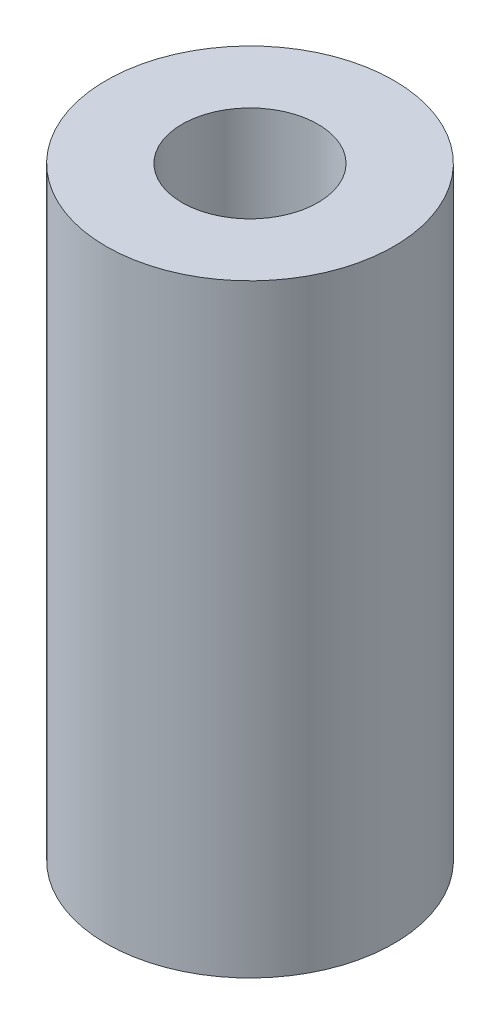
ISO-10303-21;
HEADER;
FILE_DESCRIPTION(('STEP AP214'),'2;1');
FILE_NAME('part.step','',(''),(''),'','','');
FILE_SCHEMA(('AUTOMOTIVE_DESIGN { 1 0 10303 214 1 1 1 1 }'));
ENDSEC;
DATA;
#1=APPLICATION_CONTEXT('core data for automotive mechanical design processes');
#2=APPLICATION_PROTOCOL_DEFINITION('international standard','automotive_design',2000,#1);
#3=PRODUCT_CONTEXT('',#1,'mechanical');
#4=PRODUCT('Part','Part','',(#3));
#5=PRODUCT_RELATED_PRODUCT_CATEGORY('part','',(#4));
#6=PRODUCT_DEFINITION_FORMATION('','',#4);
#7=PRODUCT_DEFINITION_CONTEXT('part definition',#1,'design');
#8=PRODUCT_DEFINITION('design','',#6,#7);
#9=PRODUCT_DEFINITION_SHAPE('','',#8);
#10=(LENGTH_UNIT() NAMED_UNIT(*) SI_UNIT(.MILLI.,.METRE.));
#11=(NAMED_UNIT(*) PLANE_ANGLE_UNIT() SI_UNIT($,.RADIAN.));
#12=(NAMED_UNIT(*) SI_UNIT($,.STERADIAN.) SOLID_ANGLE_UNIT());
#13=UNCERTAINTY_MEASURE_WITH_UNIT(LENGTH_MEASURE(1.E-05),#10,'distance_accuracy_value','');
#14=(GEOMETRIC_REPRESENTATION_CONTEXT(3) GLOBAL_UNCERTAINTY_ASSIGNED_CONTEXT((#13)) GLOBAL_UNIT_ASSIGNED_CONTEXT((#10,
#11,#12)) REPRESENTATION_CONTEXT('',''));
#15=CARTESIAN_POINT('',(0.,0.,0.));
#16=DIRECTION('',(0.,0.,1.));
#17=DIRECTION('',(1.,0.,0.));
#18=AXIS2_PLACEMENT_3D('',#15,#16,#17);
#19=CARTESIAN_POINT('',(0.,19.1,0.));
#20=DIRECTION('',(0.,1.,0.));
#21=DIRECTION('',(0.,0.,1.));
#22=AXIS2_PLACEMENT_3D('',#19,#20,#21);
#23=PLANE('',#22);
#24=CARTESIAN_POINT('',(0.,19.1,0.));
#25=DIRECTION('',(0.,1.,0.));
#26=DIRECTION('',(0.,0.,1.));
#27=AXIS2_PLACEMENT_3D('',#24,#25,#26);
#28=CIRCLE('',#27,4.55);
#29=CARTESIAN_POINT('',(0.,19.1,4.55));
#30=VERTEX_POINT('',#29);
#31=EDGE_CURVE('E10',#30,#30,#28,.T.);
#32=ORIENTED_EDGE('',*,*,#31,.T.);
#33=EDGE_LOOP('',(#32));
#34=FACE_BOUND('',#33,.T.);
#35=CARTESIAN_POINT('',(0.,19.1,0.));
#36=DIRECTION('',(0.,1.,0.));
#37=DIRECTION('',(0.,0.,1.));
#38=AXIS2_PLACEMENT_3D('',#35,#36,#37);
#39=CIRCLE('',#38,2.15);
#40=CARTESIAN_POINT('',(0.,19.1,2.15));
#41=VERTEX_POINT('',#40);
#42=EDGE_CURVE('E45',#41,#41,#39,.T.);
#43=ORIENTED_EDGE('',*,*,#42,.F.);
#44=EDGE_LOOP('',(#43));
#45=FACE_BOUND('',#44,.T.);
#46=ADVANCED_FACE('F34',(#34,#45),#23,.T.);
#47=CARTESIAN_POINT('',(0.,0.,0.));
#48=DIRECTION('',(0.,1.,0.));
#49=DIRECTION('',(0.,0.,1.));
#50=AXIS2_PLACEMENT_3D('',#47,#48,#49);
#51=PLANE('',#50);
#52=CARTESIAN_POINT('',(0.,0.,0.));
#53=DIRECTION('',(0.,1.,0.));
#54=DIRECTION('',(0.,0.,1.));
#55=AXIS2_PLACEMENT_3D('',#52,#53,#54);
#56=CIRCLE('',#55,4.55);
#57=CARTESIAN_POINT('',(0.,0.,4.55));
#58=VERTEX_POINT('',#57);
#59=EDGE_CURVE('E38',#58,#58,#56,.T.);
#60=ORIENTED_EDGE('',*,*,#59,.F.);
#61=EDGE_LOOP('',(#60));
#62=FACE_BOUND('',#61,.T.);
#63=CARTESIAN_POINT('',(0.,0.,0.));
#64=DIRECTION('',(0.,1.,0.));
#65=DIRECTION('',(0.,0.,1.));
#66=AXIS2_PLACEMENT_3D('',#63,#64,#65);
#67=CIRCLE('',#66,2.15);
#68=CARTESIAN_POINT('',(0.,0.,2.15));
#69=VERTEX_POINT('',#68);
#70=EDGE_CURVE('E47',#69,#69,#67,.T.);
#71=ORIENTED_EDGE('',*,*,#70,.T.);
#72=EDGE_LOOP('',(#71));
#73=FACE_BOUND('',#72,.T.);
#74=ADVANCED_FACE('F57',(#62,#73),#51,.F.);
#75=CARTESIAN_POINT('',(0.,19.1,0.));
#76=DIRECTION('',(0.,-1.,0.));
#77=DIRECTION('',(0.,0.,-1.));
#78=AXIS2_PLACEMENT_3D('',#75,#76,#77);
#79=CYLINDRICAL_SURFACE('',#78,4.55);
#80=ORIENTED_EDGE('',*,*,#31,.F.);
#81=EDGE_LOOP('',(#80));
#82=FACE_BOUND('',#81,.T.);
#83=ORIENTED_EDGE('',*,*,#59,.T.);
#84=EDGE_LOOP('',(#83));
#85=FACE_BOUND('',#84,.T.);
#86=ADVANCED_FACE('F36',(#82,#85),#79,.T.);
#87=CARTESIAN_POINT('',(0.,19.1,0.));
#88=DIRECTION('',(0.,-1.,0.));
#89=DIRECTION('',(0.,0.,-1.));
#90=AXIS2_PLACEMENT_3D('',#87,#88,#89);
#91=CYLINDRICAL_SURFACE('',#90,2.15);
#92=ORIENTED_EDGE('',*,*,#42,.T.);
#93=EDGE_LOOP('',(#92));
#94=FACE_BOUND('',#93,.T.);
#95=ORIENTED_EDGE('',*,*,#70,.F.);
#96=EDGE_LOOP('',(#95));
#97=FACE_BOUND('',#96,.T.);
#98=ADVANCED_FACE('F53',(#94,#97),#91,.F.);
#99=CLOSED_SHELL('',(#46,#74,#86,#98));
#100=MANIFOLD_SOLID_BREP('B2',#99);
#101=ADVANCED_BREP_SHAPE_REPRESENTATION('',(#18,#100),#14);
#102=SHAPE_DEFINITION_REPRESENTATION(#9,#101);
ENDSEC;
END-ISO-10303-21;
